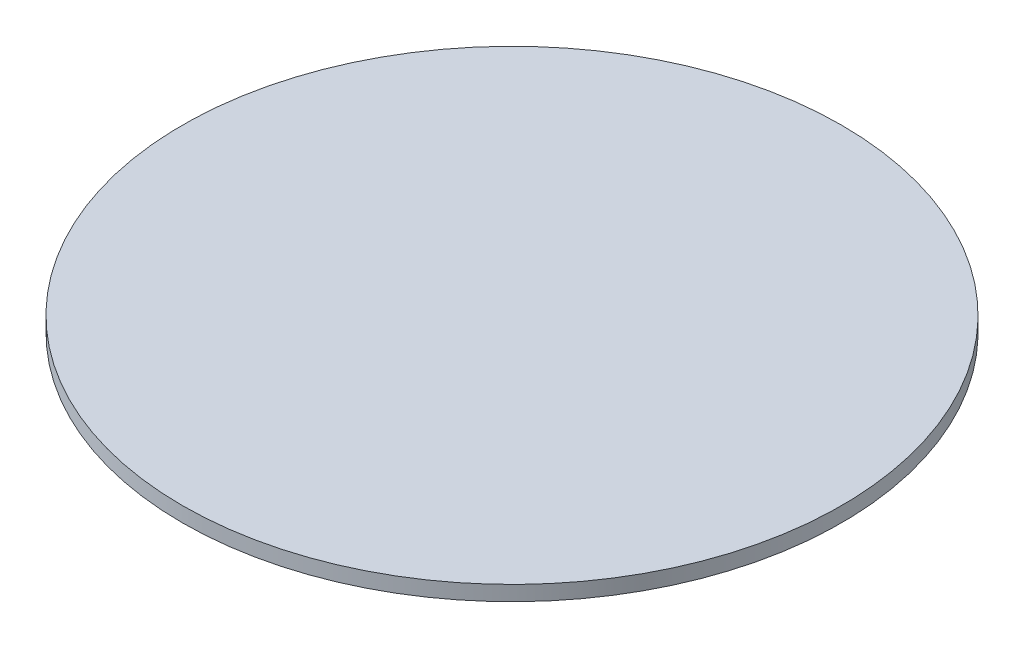
ISO-10303-21;
HEADER;
FILE_DESCRIPTION(('STEP AP214'),'2;1');
FILE_NAME('part.step','',(''),(''),'','','');
FILE_SCHEMA(('AUTOMOTIVE_DESIGN { 1 0 10303 214 1 1 1 1 }'));
ENDSEC;
DATA;
#1=APPLICATION_CONTEXT('core data for automotive mechanical design processes');
#2=APPLICATION_PROTOCOL_DEFINITION('international standard','automotive_design',2000,#1);
#3=PRODUCT_CONTEXT('',#1,'mechanical');
#4=PRODUCT('Part','Part','',(#3));
#5=PRODUCT_RELATED_PRODUCT_CATEGORY('part','',(#4));
#6=PRODUCT_DEFINITION_FORMATION('','',#4);
#7=PRODUCT_DEFINITION_CONTEXT('part definition',#1,'design');
#8=PRODUCT_DEFINITION('design','',#6,#7);
#9=PRODUCT_DEFINITION_SHAPE('','',#8);
#10=(LENGTH_UNIT() NAMED_UNIT(*) SI_UNIT(.MILLI.,.METRE.));
#11=(NAMED_UNIT(*) PLANE_ANGLE_UNIT() SI_UNIT($,.RADIAN.));
#12=(NAMED_UNIT(*) SI_UNIT($,.STERADIAN.) SOLID_ANGLE_UNIT());
#13=UNCERTAINTY_MEASURE_WITH_UNIT(LENGTH_MEASURE(1.E-05),#10,'distance_accuracy_value','');
#14=(GEOMETRIC_REPRESENTATION_CONTEXT(3) GLOBAL_UNCERTAINTY_ASSIGNED_CONTEXT((#13)) GLOBAL_UNIT_ASSIGNED_CONTEXT((#10,
#11,#12)) REPRESENTATION_CONTEXT('',''));
#15=CARTESIAN_POINT('',(0.,0.,0.));
#16=DIRECTION('',(0.,0.,1.));
#17=DIRECTION('',(1.,0.,0.));
#18=AXIS2_PLACEMENT_3D('',#15,#16,#17);
#19=CARTESIAN_POINT('',(0.,0.8,0.));
#20=DIRECTION('',(0.,-1.,0.));
#21=DIRECTION('',(0.,0.,-1.));
#22=AXIS2_PLACEMENT_3D('',#19,#20,#21);
#23=CYLINDRICAL_SURFACE('',#22,17.62);
#24=CARTESIAN_POINT('',(0.,0.8,0.));
#25=DIRECTION('',(0.,1.,0.));
#26=DIRECTION('',(0.,0.,1.));
#27=AXIS2_PLACEMENT_3D('',#24,#25,#26);
#28=CIRCLE('',#27,17.62);
#29=CARTESIAN_POINT('',(0.,0.8,17.62));
#30=VERTEX_POINT('',#29);
#31=EDGE_CURVE('E10',#30,#30,#28,.T.);
#32=ORIENTED_EDGE('',*,*,#31,.F.);
#33=EDGE_LOOP('',(#32));
#34=FACE_BOUND('',#33,.T.);
#35=CARTESIAN_POINT('',(0.,0.,0.));
#36=DIRECTION('',(0.,1.,0.));
#37=DIRECTION('',(0.,0.,1.));
#38=AXIS2_PLACEMENT_3D('',#35,#36,#37);
#39=CIRCLE('',#38,17.62);
#40=CARTESIAN_POINT('',(0.,0.,17.62));
#41=VERTEX_POINT('',#40);
#42=EDGE_CURVE('E42',#41,#41,#39,.T.);
#43=ORIENTED_EDGE('',*,*,#42,.T.);
#44=EDGE_LOOP('',(#43));
#45=FACE_BOUND('',#44,.T.);
#46=ADVANCED_FACE('F39',(#34,#45),#23,.T.);
#47=CARTESIAN_POINT('',(0.,0.8,0.));
#48=DIRECTION('',(0.,1.,0.));
#49=DIRECTION('',(0.,0.,1.));
#50=AXIS2_PLACEMENT_3D('',#47,#48,#49);
#51=PLANE('',#50);
#52=ORIENTED_EDGE('',*,*,#31,.T.);
#53=EDGE_LOOP('',(#52));
#54=FACE_BOUND('',#53,.T.);
#55=ADVANCED_FACE('F59',(#54),#51,.T.);
#56=CARTESIAN_POINT('',(0.,0.,0.));
#57=DIRECTION('',(0.,1.,0.));
#58=DIRECTION('',(0.,0.,1.));
#59=AXIS2_PLACEMENT_3D('',#56,#57,#58);
#60=PLANE('',#59);
#61=ORIENTED_EDGE('',*,*,#42,.F.);
#62=EDGE_LOOP('',(#61));
#63=FACE_BOUND('',#62,.T.);
#64=ADVANCED_FACE('F57',(#63),#60,.F.);
#65=CLOSED_SHELL('',(#46,#55,#64));
#66=MANIFOLD_SOLID_BREP('B2',#65);
#67=ADVANCED_BREP_SHAPE_REPRESENTATION('',(#18,#66),#14);
#68=SHAPE_DEFINITION_REPRESENTATION(#9,#67);
ENDSEC;
END-ISO-10303-21;
